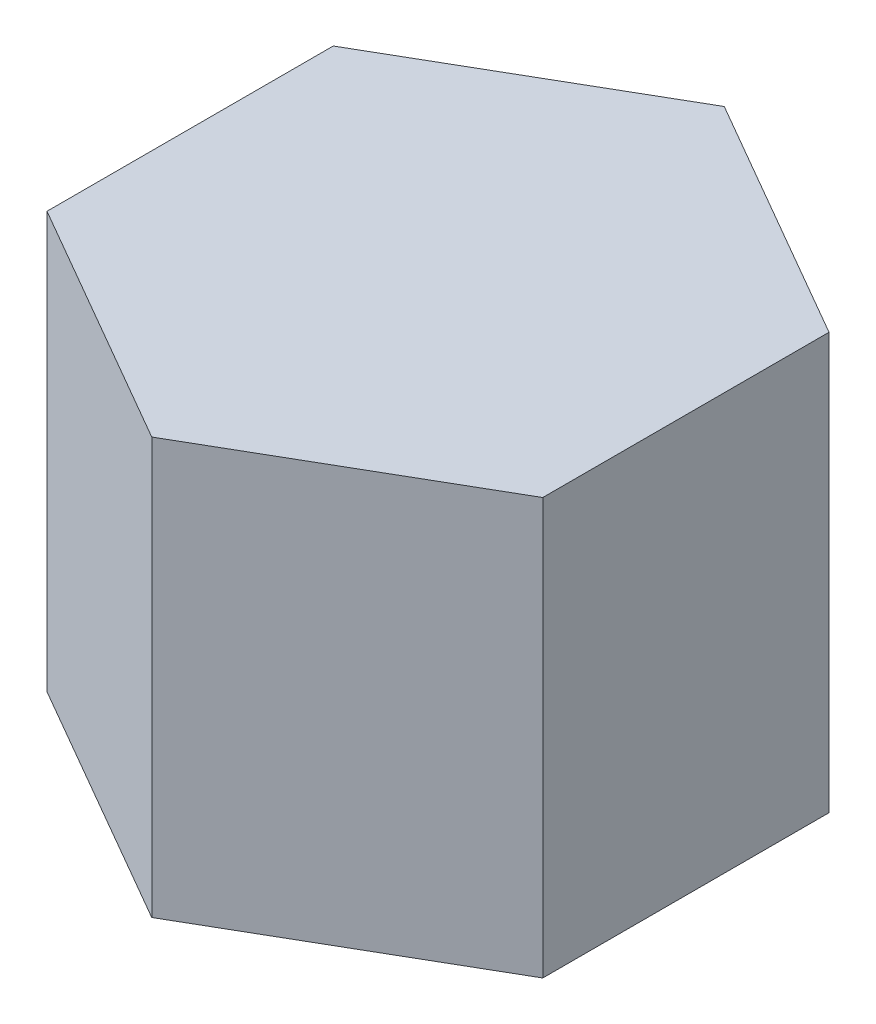
ISO-10303-21;
HEADER;
FILE_DESCRIPTION(('STEP AP214'),'2;1');
FILE_NAME('part.step','',(''),(''),'','','');
FILE_SCHEMA(('AUTOMOTIVE_DESIGN { 1 0 10303 214 1 1 1 1 }'));
ENDSEC;
DATA;
#1=APPLICATION_CONTEXT('core data for automotive mechanical design processes');
#2=APPLICATION_PROTOCOL_DEFINITION('international standard','automotive_design',2000,#1);
#3=PRODUCT_CONTEXT('',#1,'mechanical');
#4=PRODUCT('Part','Part','',(#3));
#5=PRODUCT_RELATED_PRODUCT_CATEGORY('part','',(#4));
#6=PRODUCT_DEFINITION_FORMATION('','',#4);
#7=PRODUCT_DEFINITION_CONTEXT('part definition',#1,'design');
#8=PRODUCT_DEFINITION('design','',#6,#7);
#9=PRODUCT_DEFINITION_SHAPE('','',#8);
#10=(LENGTH_UNIT() NAMED_UNIT(*) SI_UNIT(.MILLI.,.METRE.));
#11=(NAMED_UNIT(*) PLANE_ANGLE_UNIT() SI_UNIT($,.RADIAN.));
#12=(NAMED_UNIT(*) SI_UNIT($,.STERADIAN.) SOLID_ANGLE_UNIT());
#13=UNCERTAINTY_MEASURE_WITH_UNIT(LENGTH_MEASURE(1.E-05),#10,'distance_accuracy_value','');
#14=(GEOMETRIC_REPRESENTATION_CONTEXT(3) GLOBAL_UNCERTAINTY_ASSIGNED_CONTEXT((#13)) GLOBAL_UNIT_ASSIGNED_CONTEXT((#10,
#11,#12)) REPRESENTATION_CONTEXT('',''));
#15=CARTESIAN_POINT('',(0.,0.,0.));
#16=DIRECTION('',(0.,0.,1.));
#17=DIRECTION('',(1.,0.,0.));
#18=AXIS2_PLACEMENT_3D('',#15,#16,#17);
#19=CARTESIAN_POINT('',(208.339551417382,-147.556598747966,289.949920412926));
#20=DIRECTION('',(-0.499999999999943,0.,-0.866025403784471));
#21=DIRECTION('',(-0.866025403784471,0.,0.499999999999943));
#22=AXIS2_PLACEMENT_3D('',#19,#20,#21);
#23=PLANE('',#22);
#24=CARTESIAN_POINT('',(208.642660308706,-147.047793579175,289.774920412926));
#25=DIRECTION('',(-0.866025403784471,0.,0.499999999999943));
#26=VECTOR('',#25,1.);
#27=LINE('',#24,#26);
#28=CARTESIAN_POINT('',(208.642660308706,-147.047793579175,289.774920412926));
#29=VERTEX_POINT('',#28);
#30=CARTESIAN_POINT('',(208.339551417382,-147.047793579175,289.949920412926));
#31=VERTEX_POINT('',#30);
#32=EDGE_CURVE('E170',#29,#31,#27,.T.);
#33=ORIENTED_EDGE('',*,*,#32,.T.);
#34=CARTESIAN_POINT('',(208.339551417382,-147.556598747966,289.949920412926));
#35=DIRECTION('',(0.,1.,0.));
#36=VECTOR('',#35,1.);
#37=LINE('',#34,#36);
#38=CARTESIAN_POINT('',(208.339551417382,-147.556598747966,289.949920412926));
#39=VERTEX_POINT('',#38);
#40=EDGE_CURVE('E35',#39,#31,#37,.T.);
#41=ORIENTED_EDGE('',*,*,#40,.F.);
#42=CARTESIAN_POINT('',(208.642660308706,-147.556598747966,289.774920412926));
#43=DIRECTION('',(-0.866025403784471,0.,0.499999999999943));
#44=VECTOR('',#43,1.);
#45=LINE('',#42,#44);
#46=CARTESIAN_POINT('',(208.642660308706,-147.556598747966,289.774920412926));
#47=VERTEX_POINT('',#46);
#48=EDGE_CURVE('E159',#47,#39,#45,.T.);
#49=ORIENTED_EDGE('',*,*,#48,.F.);
#50=CARTESIAN_POINT('',(208.642660308706,-147.556598747966,289.774920412926));
#51=DIRECTION('',(0.,1.,0.));
#52=VECTOR('',#51,1.);
#53=LINE('',#50,#52);
#54=EDGE_CURVE('E10',#47,#29,#53,.T.);
#55=ORIENTED_EDGE('',*,*,#54,.T.);
#56=EDGE_LOOP('',(#33,#41,#49,#55));
#57=FACE_BOUND('',#56,.T.);
#58=ADVANCED_FACE('F16',(#57),#23,.F.);
#59=CARTESIAN_POINT('',(208.642660308706,-147.556598747966,291.594471220494));
#60=DIRECTION('',(-1.,0.,0.));
#61=DIRECTION('',(0.,-1.,0.));
#62=AXIS2_PLACEMENT_3D('',#59,#60,#61);
#63=PLANE('',#62);
#64=CARTESIAN_POINT('',(208.642660308706,-147.047793579175,289.424920412926));
#65=DIRECTION('',(0.,0.,1.));
#66=VECTOR('',#65,1.);
#67=LINE('',#64,#66);
#68=CARTESIAN_POINT('',(208.642660308706,-147.047793579175,289.424920412926));
#69=VERTEX_POINT('',#68);
#70=EDGE_CURVE('E167',#69,#29,#67,.T.);
#71=ORIENTED_EDGE('',*,*,#70,.T.);
#72=ORIENTED_EDGE('',*,*,#54,.F.);
#73=CARTESIAN_POINT('',(208.642660308706,-147.556598747966,289.424920412926));
#74=DIRECTION('',(0.,0.,1.));
#75=VECTOR('',#74,1.);
#76=LINE('',#73,#75);
#77=CARTESIAN_POINT('',(208.642660308706,-147.556598747966,289.424920412926));
#78=VERTEX_POINT('',#77);
#79=EDGE_CURVE('E156',#78,#47,#76,.T.);
#80=ORIENTED_EDGE('',*,*,#79,.F.);
#81=CARTESIAN_POINT('',(208.642660308706,-147.556598747966,289.424920412926));
#82=DIRECTION('',(0.,1.,0.));
#83=VECTOR('',#82,1.);
#84=LINE('',#81,#83);
#85=EDGE_CURVE('E27',#78,#69,#84,.T.);
#86=ORIENTED_EDGE('',*,*,#85,.T.);
#87=EDGE_LOOP('',(#71,#72,#80,#86));
#88=FACE_BOUND('',#87,.T.);
#89=ADVANCED_FACE('F189',(#88),#63,.F.);
#90=CARTESIAN_POINT('',(208.642660308706,-147.556598747966,289.424920412926));
#91=DIRECTION('',(-0.499999999999943,0.,0.866025403784471));
#92=DIRECTION('',(0.866025403784471,0.,0.499999999999943));
#93=AXIS2_PLACEMENT_3D('',#90,#91,#92);
#94=PLANE('',#93);
#95=CARTESIAN_POINT('',(208.339551417382,-147.047793579175,289.249920412926));
#96=DIRECTION('',(0.866025403784471,0.,0.499999999999943));
#97=VECTOR('',#96,1.);
#98=LINE('',#95,#97);
#99=CARTESIAN_POINT('',(208.339551417382,-147.047793579175,289.249920412926));
#100=VERTEX_POINT('',#99);
#101=EDGE_CURVE('E163',#100,#69,#98,.T.);
#102=ORIENTED_EDGE('',*,*,#101,.T.);
#103=ORIENTED_EDGE('',*,*,#85,.F.);
#104=CARTESIAN_POINT('',(208.339551417382,-147.556598747966,289.249920412926));
#105=DIRECTION('',(0.866025403784471,0.,0.499999999999943));
#106=VECTOR('',#105,1.);
#107=LINE('',#104,#106);
#108=CARTESIAN_POINT('',(208.339551417382,-147.556598747966,289.249920412926));
#109=VERTEX_POINT('',#108);
#110=EDGE_CURVE('E106',#109,#78,#107,.T.);
#111=ORIENTED_EDGE('',*,*,#110,.F.);
#112=CARTESIAN_POINT('',(208.339551417382,-147.556598747966,289.249920412926));
#113=DIRECTION('',(0.,1.,0.));
#114=VECTOR('',#113,1.);
#115=LINE('',#112,#114);
#116=EDGE_CURVE('E94',#109,#100,#115,.T.);
#117=ORIENTED_EDGE('',*,*,#116,.T.);
#118=EDGE_LOOP('',(#102,#103,#111,#117));
#119=FACE_BOUND('',#118,.T.);
#120=ADVANCED_FACE('F198',(#119),#94,.F.);
#121=CARTESIAN_POINT('',(208.339551417382,-147.556598747966,289.249920412926));
#122=DIRECTION('',(0.499999999999978,0.,0.866025403784452));
#123=DIRECTION('',(0.866025403784452,0.,-0.499999999999978));
#124=AXIS2_PLACEMENT_3D('',#121,#122,#123);
#125=PLANE('',#124);
#126=CARTESIAN_POINT('',(208.036442526057,-147.047793579175,289.424920412926));
#127=DIRECTION('',(0.866025403784452,0.,-0.499999999999978));
#128=VECTOR('',#127,1.);
#129=LINE('',#126,#128);
#130=CARTESIAN_POINT('',(208.036442526057,-147.047793579175,289.424920412926));
#131=VERTEX_POINT('',#130);
#132=EDGE_CURVE('E162',#131,#100,#129,.T.);
#133=ORIENTED_EDGE('',*,*,#132,.T.);
#134=ORIENTED_EDGE('',*,*,#116,.F.);
#135=CARTESIAN_POINT('',(208.036442526057,-147.556598747966,289.424920412926));
#136=DIRECTION('',(0.866025403784452,0.,-0.499999999999978));
#137=VECTOR('',#136,1.);
#138=LINE('',#135,#137);
#139=CARTESIAN_POINT('',(208.036442526057,-147.556598747966,289.424920412926));
#140=VERTEX_POINT('',#139);
#141=EDGE_CURVE('E98',#140,#109,#138,.T.);
#142=ORIENTED_EDGE('',*,*,#141,.F.);
#143=CARTESIAN_POINT('',(208.036442526057,-147.556598747966,289.424920412926));
#144=DIRECTION('',(0.,1.,0.));
#145=VECTOR('',#144,1.);
#146=LINE('',#143,#145);
#147=EDGE_CURVE('E79',#140,#131,#146,.T.);
#148=ORIENTED_EDGE('',*,*,#147,.T.);
#149=EDGE_LOOP('',(#133,#134,#142,#148));
#150=FACE_BOUND('',#149,.T.);
#151=ADVANCED_FACE('F100',(#150),#125,.F.);
#152=CARTESIAN_POINT('',(208.036442526057,-147.556598747966,291.594471220494));
#153=DIRECTION('',(1.,0.,0.));
#154=DIRECTION('',(0.,1.,0.));
#155=AXIS2_PLACEMENT_3D('',#152,#153,#154);
#156=PLANE('',#155);
#157=CARTESIAN_POINT('',(208.036442526057,-147.047793579175,289.774920412926));
#158=DIRECTION('',(0.,0.,-1.));
#159=VECTOR('',#158,1.);
#160=LINE('',#157,#159);
#161=CARTESIAN_POINT('',(208.036442526057,-147.047793579175,289.774920412926));
#162=VERTEX_POINT('',#161);
#163=EDGE_CURVE('E88',#162,#131,#160,.T.);
#164=ORIENTED_EDGE('',*,*,#163,.T.);
#165=ORIENTED_EDGE('',*,*,#147,.F.);
#166=CARTESIAN_POINT('',(208.036442526057,-147.556598747966,289.774920412926));
#167=DIRECTION('',(0.,0.,-1.));
#168=VECTOR('',#167,1.);
#169=LINE('',#166,#168);
#170=CARTESIAN_POINT('',(208.036442526057,-147.556598747966,289.774920412926));
#171=VERTEX_POINT('',#170);
#172=EDGE_CURVE('E84',#171,#140,#169,.T.);
#173=ORIENTED_EDGE('',*,*,#172,.F.);
#174=CARTESIAN_POINT('',(208.036442526057,-147.556598747966,289.774920412926));
#175=DIRECTION('',(0.,1.,0.));
#176=VECTOR('',#175,1.);
#177=LINE('',#174,#176);
#178=EDGE_CURVE('E58',#171,#162,#177,.T.);
#179=ORIENTED_EDGE('',*,*,#178,.T.);
#180=EDGE_LOOP('',(#164,#165,#173,#179));
#181=FACE_BOUND('',#180,.T.);
#182=ADVANCED_FACE('F82',(#181),#156,.F.);
#183=CARTESIAN_POINT('',(208.036442526057,-147.556598747966,289.774920412926));
#184=DIRECTION('',(0.499999999999978,0.,-0.866025403784452));
#185=DIRECTION('',(-0.866025403784452,0.,-0.499999999999978));
#186=AXIS2_PLACEMENT_3D('',#183,#184,#185);
#187=PLANE('',#186);
#188=CARTESIAN_POINT('',(208.339551417382,-147.047793579175,289.949920412926));
#189=DIRECTION('',(-0.866025403784452,0.,-0.499999999999978));
#190=VECTOR('',#189,1.);
#191=LINE('',#188,#190);
#192=EDGE_CURVE('E160',#31,#162,#191,.T.);
#193=ORIENTED_EDGE('',*,*,#192,.T.);
#194=ORIENTED_EDGE('',*,*,#178,.F.);
#195=CARTESIAN_POINT('',(208.339551417382,-147.556598747966,289.949920412926));
#196=DIRECTION('',(-0.866025403784452,0.,-0.499999999999978));
#197=VECTOR('',#196,1.);
#198=LINE('',#195,#197);
#199=EDGE_CURVE('E112',#39,#171,#198,.T.);
#200=ORIENTED_EDGE('',*,*,#199,.F.);
#201=ORIENTED_EDGE('',*,*,#40,.T.);
#202=EDGE_LOOP('',(#193,#194,#200,#201));
#203=FACE_BOUND('',#202,.T.);
#204=ADVANCED_FACE('F131',(#203),#187,.F.);
#205=CARTESIAN_POINT('',(206.491105863044,-147.556598747966,291.594471220494));
#206=DIRECTION('',(0.,1.,0.));
#207=DIRECTION('',(-1.,0.,0.));
#208=AXIS2_PLACEMENT_3D('',#205,#206,#207);
#209=PLANE('',#208);
#210=ORIENTED_EDGE('',*,*,#48,.T.);
#211=ORIENTED_EDGE('',*,*,#199,.T.);
#212=ORIENTED_EDGE('',*,*,#172,.T.);
#213=ORIENTED_EDGE('',*,*,#141,.T.);
#214=ORIENTED_EDGE('',*,*,#110,.T.);
#215=ORIENTED_EDGE('',*,*,#79,.T.);
#216=EDGE_LOOP('',(#210,#211,#212,#213,#214,#215));
#217=FACE_BOUND('',#216,.T.);
#218=ADVANCED_FACE('F111',(#217),#209,.F.);
#219=CARTESIAN_POINT('',(206.491105863044,-147.047793579175,291.594471220494));
#220=DIRECTION('',(0.,1.,0.));
#221=DIRECTION('',(-1.,0.,0.));
#222=AXIS2_PLACEMENT_3D('',#219,#220,#221);
#223=PLANE('',#222);
#224=ORIENTED_EDGE('',*,*,#32,.F.);
#225=ORIENTED_EDGE('',*,*,#70,.F.);
#226=ORIENTED_EDGE('',*,*,#101,.F.);
#227=ORIENTED_EDGE('',*,*,#132,.F.);
#228=ORIENTED_EDGE('',*,*,#163,.F.);
#229=ORIENTED_EDGE('',*,*,#192,.F.);
#230=EDGE_LOOP('',(#224,#225,#226,#227,#228,#229));
#231=FACE_BOUND('',#230,.T.);
#232=ADVANCED_FACE('F130',(#231),#223,.T.);
#233=CLOSED_SHELL('',(#58,#89,#120,#151,#182,#204,#218,#232));
#234=MANIFOLD_SOLID_BREP('B1',#233);
#235=ADVANCED_BREP_SHAPE_REPRESENTATION('',(#18,#234),#14);
#236=SHAPE_DEFINITION_REPRESENTATION(#9,#235);
ENDSEC;
END-ISO-10303-21;
